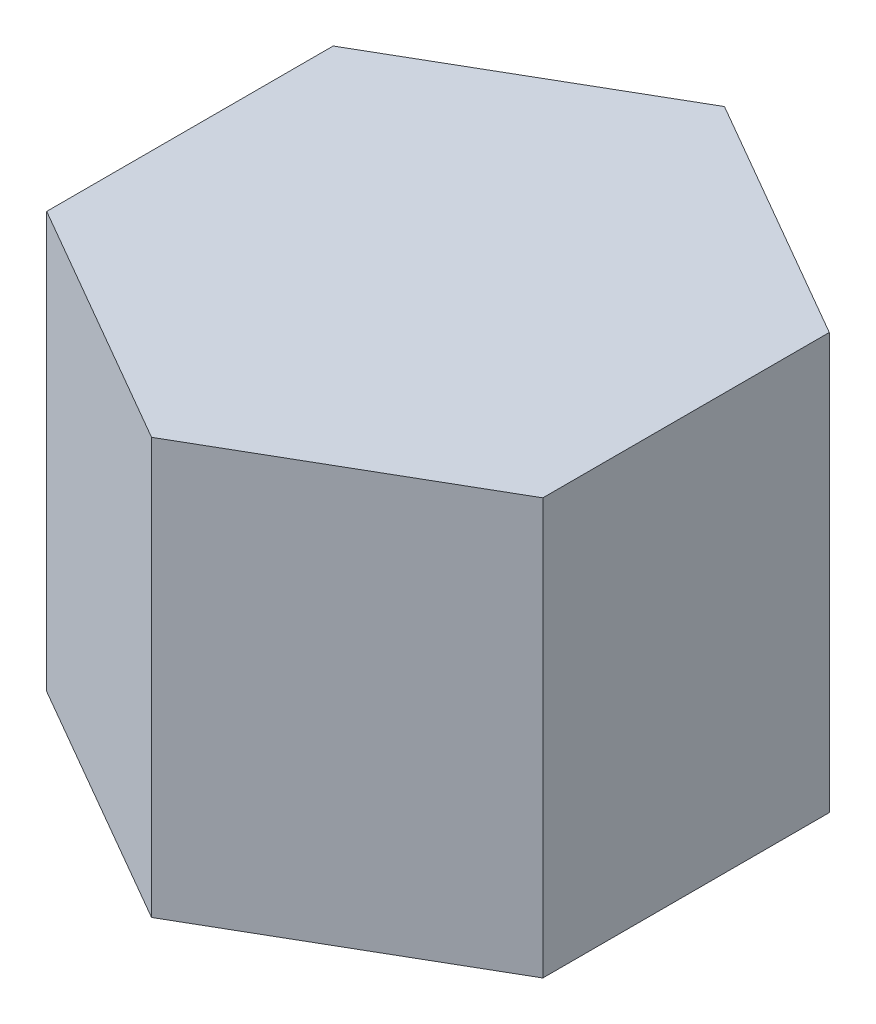
ISO-10303-21;
HEADER;
FILE_DESCRIPTION(('STEP AP214'),'2;1');
FILE_NAME('part.step','',(''),(''),'','','');
FILE_SCHEMA(('AUTOMOTIVE_DESIGN { 1 0 10303 214 1 1 1 1 }'));
ENDSEC;
DATA;
#1=APPLICATION_CONTEXT('core data for automotive mechanical design processes');
#2=APPLICATION_PROTOCOL_DEFINITION('international standard','automotive_design',2000,#1);
#3=PRODUCT_CONTEXT('',#1,'mechanical');
#4=PRODUCT('Part','Part','',(#3));
#5=PRODUCT_RELATED_PRODUCT_CATEGORY('part','',(#4));
#6=PRODUCT_DEFINITION_FORMATION('','',#4);
#7=PRODUCT_DEFINITION_CONTEXT('part definition',#1,'design');
#8=PRODUCT_DEFINITION('design','',#6,#7);
#9=PRODUCT_DEFINITION_SHAPE('','',#8);
#10=(LENGTH_UNIT() NAMED_UNIT(*) SI_UNIT(.MILLI.,.METRE.));
#11=(NAMED_UNIT(*) PLANE_ANGLE_UNIT() SI_UNIT($,.RADIAN.));
#12=(NAMED_UNIT(*) SI_UNIT($,.STERADIAN.) SOLID_ANGLE_UNIT());
#13=UNCERTAINTY_MEASURE_WITH_UNIT(LENGTH_MEASURE(1.E-05),#10,'distance_accuracy_value','');
#14=(GEOMETRIC_REPRESENTATION_CONTEXT(3) GLOBAL_UNCERTAINTY_ASSIGNED_CONTEXT((#13)) GLOBAL_UNIT_ASSIGNED_CONTEXT((#10,
#11,#12)) REPRESENTATION_CONTEXT('',''));
#15=CARTESIAN_POINT('',(0.,0.,0.));
#16=DIRECTION('',(0.,0.,1.));
#17=DIRECTION('',(1.,0.,0.));
#18=AXIS2_PLACEMENT_3D('',#15,#16,#17);
#19=CARTESIAN_POINT('',(208.642660308706,-148.537700895744,288.042869605357));
#20=DIRECTION('',(-0.499999999999978,0.,-0.866025403784452));
#21=DIRECTION('',(-0.866025403784452,0.,0.499999999999978));
#22=AXIS2_PLACEMENT_3D('',#19,#20,#21);
#23=PLANE('',#22);
#24=CARTESIAN_POINT('',(208.339551417382,-149.045793579175,288.217869605357));
#25=DIRECTION('',(0.866025403784452,0.,-0.499999999999978));
#26=VECTOR('',#25,1.);
#27=LINE('',#24,#26);
#28=CARTESIAN_POINT('',(208.339551417382,-149.045793579175,288.217869605357));
#29=VERTEX_POINT('',#28);
#30=CARTESIAN_POINT('',(208.642660308706,-149.045793579175,288.042869605357));
#31=VERTEX_POINT('',#30);
#32=EDGE_CURVE('E170',#29,#31,#27,.T.);
#33=ORIENTED_EDGE('',*,*,#32,.T.);
#34=CARTESIAN_POINT('',(208.642660308706,-148.537700895744,288.042869605357));
#35=DIRECTION('',(0.,-1.,0.));
#36=VECTOR('',#35,1.);
#37=LINE('',#34,#36);
#38=CARTESIAN_POINT('',(208.642660308706,-148.537700895744,288.042869605357));
#39=VERTEX_POINT('',#38);
#40=EDGE_CURVE('E35',#39,#31,#37,.T.);
#41=ORIENTED_EDGE('',*,*,#40,.F.);
#42=CARTESIAN_POINT('',(208.339551417382,-148.537700895744,288.217869605357));
#43=DIRECTION('',(0.866025403784452,0.,-0.499999999999978));
#44=VECTOR('',#43,1.);
#45=LINE('',#42,#44);
#46=CARTESIAN_POINT('',(208.339551417382,-148.537700895744,288.217869605357));
#47=VERTEX_POINT('',#46);
#48=EDGE_CURVE('E159',#47,#39,#45,.T.);
#49=ORIENTED_EDGE('',*,*,#48,.F.);
#50=CARTESIAN_POINT('',(208.339551417382,-148.537700895744,288.217869605357));
#51=DIRECTION('',(0.,-1.,0.));
#52=VECTOR('',#51,1.);
#53=LINE('',#50,#52);
#54=EDGE_CURVE('E10',#47,#29,#53,.T.);
#55=ORIENTED_EDGE('',*,*,#54,.T.);
#56=EDGE_LOOP('',(#33,#41,#49,#55));
#57=FACE_BOUND('',#56,.T.);
#58=ADVANCED_FACE('F16',(#57),#23,.F.);
#59=CARTESIAN_POINT('',(208.339551417382,-148.537700895744,288.217869605357));
#60=DIRECTION('',(0.499999999999943,0.,-0.866025403784472));
#61=DIRECTION('',(-0.866025403784472,0.,-0.499999999999943));
#62=AXIS2_PLACEMENT_3D('',#59,#60,#61);
#63=PLANE('',#62);
#64=CARTESIAN_POINT('',(208.036442526057,-149.045793579175,288.042869605357));
#65=DIRECTION('',(0.866025403784471,0.,0.499999999999943));
#66=VECTOR('',#65,1.);
#67=LINE('',#64,#66);
#68=CARTESIAN_POINT('',(208.036442526057,-149.045793579175,288.042869605357));
#69=VERTEX_POINT('',#68);
#70=EDGE_CURVE('E167',#69,#29,#67,.T.);
#71=ORIENTED_EDGE('',*,*,#70,.T.);
#72=ORIENTED_EDGE('',*,*,#54,.F.);
#73=CARTESIAN_POINT('',(208.036442526057,-148.537700895744,288.042869605357));
#74=DIRECTION('',(0.866025403784471,0.,0.499999999999943));
#75=VECTOR('',#74,1.);
#76=LINE('',#73,#75);
#77=CARTESIAN_POINT('',(208.036442526057,-148.537700895744,288.042869605357));
#78=VERTEX_POINT('',#77);
#79=EDGE_CURVE('E156',#78,#47,#76,.T.);
#80=ORIENTED_EDGE('',*,*,#79,.F.);
#81=CARTESIAN_POINT('',(208.036442526057,-148.537700895744,288.042869605357));
#82=DIRECTION('',(0.,-1.,0.));
#83=VECTOR('',#82,1.);
#84=LINE('',#81,#83);
#85=EDGE_CURVE('E27',#78,#69,#84,.T.);
#86=ORIENTED_EDGE('',*,*,#85,.T.);
#87=EDGE_LOOP('',(#71,#72,#80,#86));
#88=FACE_BOUND('',#87,.T.);
#89=ADVANCED_FACE('F189',(#88),#63,.F.);
#90=CARTESIAN_POINT('',(208.036442526057,-148.537700895744,290.831971220494));
#91=DIRECTION('',(1.,0.,0.));
#92=DIRECTION('',(0.,1.,0.));
#93=AXIS2_PLACEMENT_3D('',#90,#91,#92);
#94=PLANE('',#93);
#95=CARTESIAN_POINT('',(208.036442526057,-149.045793579175,287.692869605357));
#96=DIRECTION('',(0.,0.,1.));
#97=VECTOR('',#96,1.);
#98=LINE('',#95,#97);
#99=CARTESIAN_POINT('',(208.036442526057,-149.045793579175,287.692869605357));
#100=VERTEX_POINT('',#99);
#101=EDGE_CURVE('E163',#100,#69,#98,.T.);
#102=ORIENTED_EDGE('',*,*,#101,.T.);
#103=ORIENTED_EDGE('',*,*,#85,.F.);
#104=CARTESIAN_POINT('',(208.036442526057,-148.537700895744,287.692869605357));
#105=DIRECTION('',(0.,0.,1.));
#106=VECTOR('',#105,1.);
#107=LINE('',#104,#106);
#108=CARTESIAN_POINT('',(208.036442526057,-148.537700895744,287.692869605357));
#109=VERTEX_POINT('',#108);
#110=EDGE_CURVE('E106',#109,#78,#107,.T.);
#111=ORIENTED_EDGE('',*,*,#110,.F.);
#112=CARTESIAN_POINT('',(208.036442526057,-148.537700895744,287.692869605357));
#113=DIRECTION('',(0.,-1.,0.));
#114=VECTOR('',#113,1.);
#115=LINE('',#112,#114);
#116=EDGE_CURVE('E94',#109,#100,#115,.T.);
#117=ORIENTED_EDGE('',*,*,#116,.T.);
#118=EDGE_LOOP('',(#102,#103,#111,#117));
#119=FACE_BOUND('',#118,.T.);
#120=ADVANCED_FACE('F198',(#119),#94,.F.);
#121=CARTESIAN_POINT('',(208.036442526057,-148.537700895744,287.692869605357));
#122=DIRECTION('',(0.499999999999978,0.,0.866025403784452));
#123=DIRECTION('',(0.866025403784452,0.,-0.499999999999978));
#124=AXIS2_PLACEMENT_3D('',#121,#122,#123);
#125=PLANE('',#124);
#126=CARTESIAN_POINT('',(208.339551417382,-149.045793579175,287.517869605357));
#127=DIRECTION('',(-0.866025403784452,0.,0.499999999999978));
#128=VECTOR('',#127,1.);
#129=LINE('',#126,#128);
#130=CARTESIAN_POINT('',(208.339551417382,-149.045793579175,287.517869605357));
#131=VERTEX_POINT('',#130);
#132=EDGE_CURVE('E162',#131,#100,#129,.T.);
#133=ORIENTED_EDGE('',*,*,#132,.T.);
#134=ORIENTED_EDGE('',*,*,#116,.F.);
#135=CARTESIAN_POINT('',(208.339551417382,-148.537700895744,287.517869605357));
#136=DIRECTION('',(-0.866025403784452,0.,0.499999999999978));
#137=VECTOR('',#136,1.);
#138=LINE('',#135,#137);
#139=CARTESIAN_POINT('',(208.339551417382,-148.537700895744,287.517869605357));
#140=VERTEX_POINT('',#139);
#141=EDGE_CURVE('E98',#140,#109,#138,.T.);
#142=ORIENTED_EDGE('',*,*,#141,.F.);
#143=CARTESIAN_POINT('',(208.339551417382,-148.537700895744,287.517869605357));
#144=DIRECTION('',(0.,-1.,0.));
#145=VECTOR('',#144,1.);
#146=LINE('',#143,#145);
#147=EDGE_CURVE('E79',#140,#131,#146,.T.);
#148=ORIENTED_EDGE('',*,*,#147,.T.);
#149=EDGE_LOOP('',(#133,#134,#142,#148));
#150=FACE_BOUND('',#149,.T.);
#151=ADVANCED_FACE('F100',(#150),#125,.F.);
#152=CARTESIAN_POINT('',(208.339551417382,-148.537700895744,287.517869605357));
#153=DIRECTION('',(-0.499999999999943,0.,0.866025403784472));
#154=DIRECTION('',(0.866025403784472,0.,0.499999999999943));
#155=AXIS2_PLACEMENT_3D('',#152,#153,#154);
#156=PLANE('',#155);
#157=CARTESIAN_POINT('',(208.642660308706,-149.045793579175,287.692869605357));
#158=DIRECTION('',(-0.866025403784471,0.,-0.499999999999943));
#159=VECTOR('',#158,1.);
#160=LINE('',#157,#159);
#161=CARTESIAN_POINT('',(208.642660308706,-149.045793579175,287.692869605357));
#162=VERTEX_POINT('',#161);
#163=EDGE_CURVE('E88',#162,#131,#160,.T.);
#164=ORIENTED_EDGE('',*,*,#163,.T.);
#165=ORIENTED_EDGE('',*,*,#147,.F.);
#166=CARTESIAN_POINT('',(208.642660308706,-148.537700895744,287.692869605357));
#167=DIRECTION('',(-0.866025403784471,0.,-0.499999999999943));
#168=VECTOR('',#167,1.);
#169=LINE('',#166,#168);
#170=CARTESIAN_POINT('',(208.642660308706,-148.537700895744,287.692869605357));
#171=VERTEX_POINT('',#170);
#172=EDGE_CURVE('E84',#171,#140,#169,.T.);
#173=ORIENTED_EDGE('',*,*,#172,.F.);
#174=CARTESIAN_POINT('',(208.642660308706,-148.537700895744,287.692869605357));
#175=DIRECTION('',(0.,-1.,0.));
#176=VECTOR('',#175,1.);
#177=LINE('',#174,#176);
#178=EDGE_CURVE('E58',#171,#162,#177,.T.);
#179=ORIENTED_EDGE('',*,*,#178,.T.);
#180=EDGE_LOOP('',(#164,#165,#173,#179));
#181=FACE_BOUND('',#180,.T.);
#182=ADVANCED_FACE('F82',(#181),#156,.F.);
#183=CARTESIAN_POINT('',(208.642660308706,-148.537700895744,290.831971220494));
#184=DIRECTION('',(-1.,0.,0.));
#185=DIRECTION('',(0.,-1.,0.));
#186=AXIS2_PLACEMENT_3D('',#183,#184,#185);
#187=PLANE('',#186);
#188=CARTESIAN_POINT('',(208.642660308706,-149.045793579175,288.042869605357));
#189=DIRECTION('',(0.,0.,-1.));
#190=VECTOR('',#189,1.);
#191=LINE('',#188,#190);
#192=EDGE_CURVE('E160',#31,#162,#191,.T.);
#193=ORIENTED_EDGE('',*,*,#192,.T.);
#194=ORIENTED_EDGE('',*,*,#178,.F.);
#195=CARTESIAN_POINT('',(208.642660308706,-148.537700895744,288.042869605357));
#196=DIRECTION('',(0.,0.,-1.));
#197=VECTOR('',#196,1.);
#198=LINE('',#195,#197);
#199=EDGE_CURVE('E112',#39,#171,#198,.T.);
#200=ORIENTED_EDGE('',*,*,#199,.F.);
#201=ORIENTED_EDGE('',*,*,#40,.T.);
#202=EDGE_LOOP('',(#193,#194,#200,#201));
#203=FACE_BOUND('',#202,.T.);
#204=ADVANCED_FACE('F131',(#203),#187,.F.);
#205=CARTESIAN_POINT('',(206.339551417382,-148.537700895744,290.831971220494));
#206=DIRECTION('',(0.,-1.,0.));
#207=DIRECTION('',(1.,0.,0.));
#208=AXIS2_PLACEMENT_3D('',#205,#206,#207);
#209=PLANE('',#208);
#210=ORIENTED_EDGE('',*,*,#48,.T.);
#211=ORIENTED_EDGE('',*,*,#199,.T.);
#212=ORIENTED_EDGE('',*,*,#172,.T.);
#213=ORIENTED_EDGE('',*,*,#141,.T.);
#214=ORIENTED_EDGE('',*,*,#110,.T.);
#215=ORIENTED_EDGE('',*,*,#79,.T.);
#216=EDGE_LOOP('',(#210,#211,#212,#213,#214,#215));
#217=FACE_BOUND('',#216,.T.);
#218=ADVANCED_FACE('F111',(#217),#209,.F.);
#219=CARTESIAN_POINT('',(206.339551417382,-149.045793579175,290.831971220494));
#220=DIRECTION('',(0.,-1.,0.));
#221=DIRECTION('',(1.,0.,0.));
#222=AXIS2_PLACEMENT_3D('',#219,#220,#221);
#223=PLANE('',#222);
#224=ORIENTED_EDGE('',*,*,#32,.F.);
#225=ORIENTED_EDGE('',*,*,#70,.F.);
#226=ORIENTED_EDGE('',*,*,#101,.F.);
#227=ORIENTED_EDGE('',*,*,#132,.F.);
#228=ORIENTED_EDGE('',*,*,#163,.F.);
#229=ORIENTED_EDGE('',*,*,#192,.F.);
#230=EDGE_LOOP('',(#224,#225,#226,#227,#228,#229));
#231=FACE_BOUND('',#230,.T.);
#232=ADVANCED_FACE('F130',(#231),#223,.T.);
#233=CLOSED_SHELL('',(#58,#89,#120,#151,#182,#204,#218,#232));
#234=MANIFOLD_SOLID_BREP('B1',#233);
#235=ADVANCED_BREP_SHAPE_REPRESENTATION('',(#18,#234),#14);
#236=SHAPE_DEFINITION_REPRESENTATION(#9,#235);
ENDSEC;
END-ISO-10303-21;
